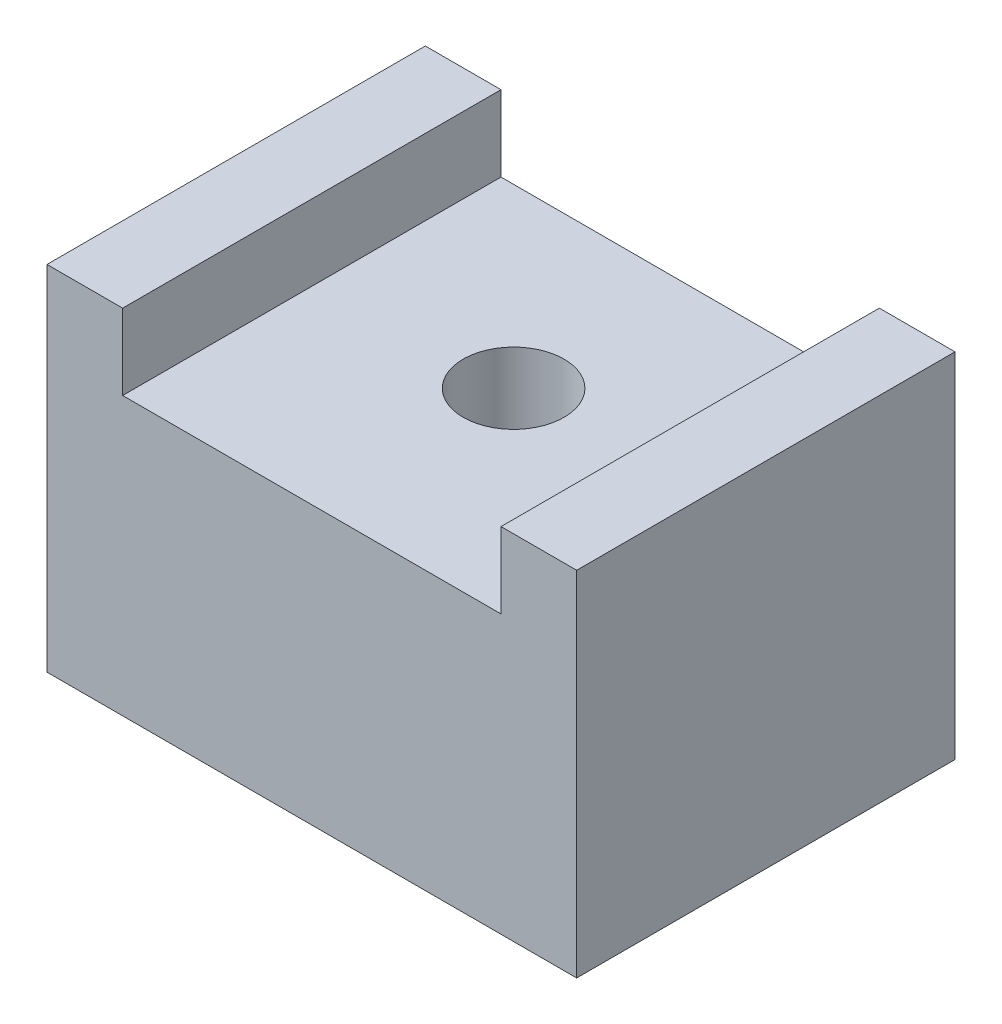
ISO-10303-21;
HEADER;
FILE_DESCRIPTION(('STEP AP214'),'2;1');
FILE_NAME('part.step','',(''),(''),'','','');
FILE_SCHEMA(('AUTOMOTIVE_DESIGN { 1 0 10303 214 1 1 1 1 }'));
ENDSEC;
DATA;
#1=APPLICATION_CONTEXT('core data for automotive mechanical design processes');
#2=APPLICATION_PROTOCOL_DEFINITION('international standard','automotive_design',2000,#1);
#3=PRODUCT_CONTEXT('',#1,'mechanical');
#4=PRODUCT('Part','Part','',(#3));
#5=PRODUCT_RELATED_PRODUCT_CATEGORY('part','',(#4));
#6=PRODUCT_DEFINITION_FORMATION('','',#4);
#7=PRODUCT_DEFINITION_CONTEXT('part definition',#1,'design');
#8=PRODUCT_DEFINITION('design','',#6,#7);
#9=PRODUCT_DEFINITION_SHAPE('','',#8);
#10=(LENGTH_UNIT() NAMED_UNIT(*) SI_UNIT(.MILLI.,.METRE.));
#11=(NAMED_UNIT(*) PLANE_ANGLE_UNIT() SI_UNIT($,.RADIAN.));
#12=(NAMED_UNIT(*) SI_UNIT($,.STERADIAN.) SOLID_ANGLE_UNIT());
#13=UNCERTAINTY_MEASURE_WITH_UNIT(LENGTH_MEASURE(1.E-05),#10,'distance_accuracy_value','');
#14=(GEOMETRIC_REPRESENTATION_CONTEXT(3) GLOBAL_UNCERTAINTY_ASSIGNED_CONTEXT((#13)) GLOBAL_UNIT_ASSIGNED_CONTEXT((#10,
#11,#12)) REPRESENTATION_CONTEXT('',''));
#15=CARTESIAN_POINT('',(0.,0.,0.));
#16=DIRECTION('',(0.,0.,1.));
#17=DIRECTION('',(1.,0.,0.));
#18=AXIS2_PLACEMENT_3D('',#15,#16,#17);
#19=CARTESIAN_POINT('',(10.5,-11.,15.));
#20=DIRECTION('',(-1.,0.,0.));
#21=DIRECTION('',(0.,-1.,0.));
#22=AXIS2_PLACEMENT_3D('',#19,#20,#21);
#23=PLANE('',#22);
#24=DIRECTION('',(0.,1.,0.));
#25=VECTOR('',#24,1.);
#26=CARTESIAN_POINT('',(10.5,-11.,0.));
#27=LINE('',#26,#25);
#28=CARTESIAN_POINT('',(10.5,-11.,0.));
#29=VERTEX_POINT('',#28);
#30=CARTESIAN_POINT('',(10.5,3.,0.));
#31=VERTEX_POINT('',#30);
#32=EDGE_CURVE('E129',#29,#31,#27,.T.);
#33=ORIENTED_EDGE('',*,*,#32,.T.);
#34=DIRECTION('',(0.,0.,-1.));
#35=VECTOR('',#34,1.);
#36=CARTESIAN_POINT('',(10.5,3.,15.));
#37=LINE('',#36,#35);
#38=CARTESIAN_POINT('',(10.5,3.,15.));
#39=VERTEX_POINT('',#38);
#40=EDGE_CURVE('E11',#39,#31,#37,.T.);
#41=ORIENTED_EDGE('',*,*,#40,.F.);
#42=DIRECTION('',(0.,1.,0.));
#43=VECTOR('',#42,1.);
#44=CARTESIAN_POINT('',(10.5,-11.,15.));
#45=LINE('',#44,#43);
#46=CARTESIAN_POINT('',(10.5,-11.,15.));
#47=VERTEX_POINT('',#46);
#48=EDGE_CURVE('E144',#47,#39,#45,.T.);
#49=ORIENTED_EDGE('',*,*,#48,.F.);
#50=DIRECTION('',(0.,0.,-1.));
#51=VECTOR('',#50,1.);
#52=CARTESIAN_POINT('',(10.5,-11.,15.));
#53=LINE('',#52,#51);
#54=EDGE_CURVE('E125',#47,#29,#53,.T.);
#55=ORIENTED_EDGE('',*,*,#54,.T.);
#56=EDGE_LOOP('',(#33,#41,#49,#55));
#57=FACE_BOUND('',#56,.T.);
#58=ADVANCED_FACE('F33',(#57),#23,.F.);
#59=CARTESIAN_POINT('',(10.5,3.,15.));
#60=DIRECTION('',(0.,-1.,0.));
#61=DIRECTION('',(1.,0.,0.));
#62=AXIS2_PLACEMENT_3D('',#59,#60,#61);
#63=PLANE('',#62);
#64=DIRECTION('',(-1.,0.,0.));
#65=VECTOR('',#64,1.);
#66=CARTESIAN_POINT('',(10.5,3.,0.));
#67=LINE('',#66,#65);
#68=CARTESIAN_POINT('',(7.5,3.,0.));
#69=VERTEX_POINT('',#68);
#70=EDGE_CURVE('E132',#31,#69,#67,.T.);
#71=ORIENTED_EDGE('',*,*,#70,.T.);
#72=DIRECTION('',(0.,0.,-1.));
#73=VECTOR('',#72,1.);
#74=CARTESIAN_POINT('',(7.5,3.,15.));
#75=LINE('',#74,#73);
#76=CARTESIAN_POINT('',(7.5,3.,15.));
#77=VERTEX_POINT('',#76);
#78=EDGE_CURVE('E41',#77,#69,#75,.T.);
#79=ORIENTED_EDGE('',*,*,#78,.F.);
#80=DIRECTION('',(-1.,0.,0.));
#81=VECTOR('',#80,1.);
#82=CARTESIAN_POINT('',(10.5,3.,15.));
#83=LINE('',#82,#81);
#84=EDGE_CURVE('E92',#39,#77,#83,.T.);
#85=ORIENTED_EDGE('',*,*,#84,.F.);
#86=ORIENTED_EDGE('',*,*,#40,.T.);
#87=EDGE_LOOP('',(#71,#79,#85,#86));
#88=FACE_BOUND('',#87,.T.);
#89=ADVANCED_FACE('F192',(#88),#63,.F.);
#90=CARTESIAN_POINT('',(7.5,3.,15.));
#91=DIRECTION('',(1.,0.,0.));
#92=DIRECTION('',(0.,1.,0.));
#93=AXIS2_PLACEMENT_3D('',#90,#91,#92);
#94=PLANE('',#93);
#95=DIRECTION('',(0.,-1.,0.));
#96=VECTOR('',#95,1.);
#97=CARTESIAN_POINT('',(7.5,3.,0.));
#98=LINE('',#97,#96);
#99=CARTESIAN_POINT('',(7.5,0.,0.));
#100=VERTEX_POINT('',#99);
#101=EDGE_CURVE('E135',#69,#100,#98,.T.);
#102=ORIENTED_EDGE('',*,*,#101,.T.);
#103=DIRECTION('',(0.,0.,-1.));
#104=VECTOR('',#103,1.);
#105=CARTESIAN_POINT('',(7.5,0.,15.));
#106=LINE('',#105,#104);
#107=CARTESIAN_POINT('',(7.5,0.,15.));
#108=VERTEX_POINT('',#107);
#109=EDGE_CURVE('E151',#108,#100,#106,.T.);
#110=ORIENTED_EDGE('',*,*,#109,.F.);
#111=DIRECTION('',(0.,-1.,0.));
#112=VECTOR('',#111,1.);
#113=CARTESIAN_POINT('',(7.5,3.,15.));
#114=LINE('',#113,#112);
#115=EDGE_CURVE('E159',#77,#108,#114,.T.);
#116=ORIENTED_EDGE('',*,*,#115,.F.);
#117=ORIENTED_EDGE('',*,*,#78,.T.);
#118=EDGE_LOOP('',(#102,#110,#116,#117));
#119=FACE_BOUND('',#118,.T.);
#120=ADVANCED_FACE('F157',(#119),#94,.F.);
#121=CARTESIAN_POINT('',(7.5,0.,15.));
#122=DIRECTION('',(0.,-1.,0.));
#123=DIRECTION('',(0.,0.,-1.));
#124=AXIS2_PLACEMENT_3D('',#121,#122,#123);
#125=PLANE('',#124);
#126=CARTESIAN_POINT('',(0.,0.,7.));
#127=DIRECTION('',(0.,1.,0.));
#128=DIRECTION('',(0.,0.,1.));
#129=AXIS2_PLACEMENT_3D('',#126,#127,#128);
#130=CIRCLE('',#129,2.);
#131=CARTESIAN_POINT('',(0.,0.,9.));
#132=VERTEX_POINT('',#131);
#133=EDGE_CURVE('E179',#132,#132,#130,.T.);
#134=ORIENTED_EDGE('',*,*,#133,.F.);
#135=EDGE_LOOP('',(#134));
#136=FACE_BOUND('',#135,.T.);
#137=DIRECTION('',(-1.,0.,0.));
#138=VECTOR('',#137,1.);
#139=CARTESIAN_POINT('',(7.5,0.,0.));
#140=LINE('',#139,#138);
#141=CARTESIAN_POINT('',(-7.5,0.,0.));
#142=VERTEX_POINT('',#141);
#143=EDGE_CURVE('E137',#100,#142,#140,.T.);
#144=ORIENTED_EDGE('',*,*,#143,.T.);
#145=DIRECTION('',(0.,0.,-1.));
#146=VECTOR('',#145,1.);
#147=CARTESIAN_POINT('',(-7.5,0.,15.));
#148=LINE('',#147,#146);
#149=CARTESIAN_POINT('',(-7.5,0.,15.));
#150=VERTEX_POINT('',#149);
#151=EDGE_CURVE('E148',#150,#142,#148,.T.);
#152=ORIENTED_EDGE('',*,*,#151,.F.);
#153=DIRECTION('',(-1.,0.,0.));
#154=VECTOR('',#153,1.);
#155=CARTESIAN_POINT('',(7.5,0.,15.));
#156=LINE('',#155,#154);
#157=EDGE_CURVE('E171',#108,#150,#156,.T.);
#158=ORIENTED_EDGE('',*,*,#157,.F.);
#159=ORIENTED_EDGE('',*,*,#109,.T.);
#160=EDGE_LOOP('',(#144,#152,#158,#159));
#161=FACE_BOUND('',#160,.T.);
#162=ADVANCED_FACE('F167',(#136,#161),#125,.F.);
#163=CARTESIAN_POINT('',(-7.5,0.,15.));
#164=DIRECTION('',(-1.,0.,0.));
#165=DIRECTION('',(0.,0.,1.));
#166=AXIS2_PLACEMENT_3D('',#163,#164,#165);
#167=PLANE('',#166);
#168=DIRECTION('',(0.,1.,0.));
#169=VECTOR('',#168,1.);
#170=CARTESIAN_POINT('',(-7.5,0.,0.));
#171=LINE('',#170,#169);
#172=CARTESIAN_POINT('',(-7.5,3.,0.));
#173=VERTEX_POINT('',#172);
#174=EDGE_CURVE('E139',#142,#173,#171,.T.);
#175=ORIENTED_EDGE('',*,*,#174,.T.);
#176=DIRECTION('',(0.,0.,-1.));
#177=VECTOR('',#176,1.);
#178=CARTESIAN_POINT('',(-7.5,3.,15.));
#179=LINE('',#178,#177);
#180=CARTESIAN_POINT('',(-7.5,3.,15.));
#181=VERTEX_POINT('',#180);
#182=EDGE_CURVE('E120',#181,#173,#179,.T.);
#183=ORIENTED_EDGE('',*,*,#182,.F.);
#184=DIRECTION('',(0.,1.,0.));
#185=VECTOR('',#184,1.);
#186=CARTESIAN_POINT('',(-7.5,0.,15.));
#187=LINE('',#186,#185);
#188=EDGE_CURVE('E111',#150,#181,#187,.T.);
#189=ORIENTED_EDGE('',*,*,#188,.F.);
#190=ORIENTED_EDGE('',*,*,#151,.T.);
#191=EDGE_LOOP('',(#175,#183,#189,#190));
#192=FACE_BOUND('',#191,.T.);
#193=ADVANCED_FACE('F170',(#192),#167,.F.);
#194=CARTESIAN_POINT('',(-7.5,3.,15.));
#195=DIRECTION('',(0.,-1.,0.));
#196=DIRECTION('',(1.,0.,0.));
#197=AXIS2_PLACEMENT_3D('',#194,#195,#196);
#198=PLANE('',#197);
#199=DIRECTION('',(-1.,0.,0.));
#200=VECTOR('',#199,1.);
#201=CARTESIAN_POINT('',(-7.5,3.,0.));
#202=LINE('',#201,#200);
#203=CARTESIAN_POINT('',(-10.5,3.,0.));
#204=VERTEX_POINT('',#203);
#205=EDGE_CURVE('E119',#173,#204,#202,.T.);
#206=ORIENTED_EDGE('',*,*,#205,.T.);
#207=DIRECTION('',(0.,0.,-1.));
#208=VECTOR('',#207,1.);
#209=CARTESIAN_POINT('',(-10.5,3.,15.));
#210=LINE('',#209,#208);
#211=CARTESIAN_POINT('',(-10.5,3.,15.));
#212=VERTEX_POINT('',#211);
#213=EDGE_CURVE('E116',#212,#204,#210,.T.);
#214=ORIENTED_EDGE('',*,*,#213,.F.);
#215=DIRECTION('',(-1.,0.,0.));
#216=VECTOR('',#215,1.);
#217=CARTESIAN_POINT('',(-7.5,3.,15.));
#218=LINE('',#217,#216);
#219=EDGE_CURVE('E105',#181,#212,#218,.T.);
#220=ORIENTED_EDGE('',*,*,#219,.F.);
#221=ORIENTED_EDGE('',*,*,#182,.T.);
#222=EDGE_LOOP('',(#206,#214,#220,#221));
#223=FACE_BOUND('',#222,.T.);
#224=ADVANCED_FACE('F117',(#223),#198,.F.);
#225=CARTESIAN_POINT('',(-10.5,3.,15.));
#226=DIRECTION('',(1.,0.,0.));
#227=DIRECTION('',(0.,1.,0.));
#228=AXIS2_PLACEMENT_3D('',#225,#226,#227);
#229=PLANE('',#228);
#230=DIRECTION('',(0.,-1.,0.));
#231=VECTOR('',#230,1.);
#232=CARTESIAN_POINT('',(-10.5,3.,0.));
#233=LINE('',#232,#231);
#234=CARTESIAN_POINT('',(-10.5,-11.,0.));
#235=VERTEX_POINT('',#234);
#236=EDGE_CURVE('E78',#204,#235,#233,.T.);
#237=ORIENTED_EDGE('',*,*,#236,.T.);
#238=DIRECTION('',(0.,0.,-1.));
#239=VECTOR('',#238,1.);
#240=CARTESIAN_POINT('',(-10.5,-11.,15.));
#241=LINE('',#240,#239);
#242=CARTESIAN_POINT('',(-10.5,-11.,15.));
#243=VERTEX_POINT('',#242);
#244=EDGE_CURVE('E121',#243,#235,#241,.T.);
#245=ORIENTED_EDGE('',*,*,#244,.F.);
#246=DIRECTION('',(0.,-1.,0.));
#247=VECTOR('',#246,1.);
#248=CARTESIAN_POINT('',(-10.5,3.,15.));
#249=LINE('',#248,#247);
#250=EDGE_CURVE('E109',#212,#243,#249,.T.);
#251=ORIENTED_EDGE('',*,*,#250,.F.);
#252=ORIENTED_EDGE('',*,*,#213,.T.);
#253=EDGE_LOOP('',(#237,#245,#251,#252));
#254=FACE_BOUND('',#253,.T.);
#255=ADVANCED_FACE('F123',(#254),#229,.F.);
#256=CARTESIAN_POINT('',(-10.5,-11.,15.));
#257=DIRECTION('',(0.,1.,0.));
#258=DIRECTION('',(-1.,0.,0.));
#259=AXIS2_PLACEMENT_3D('',#256,#257,#258);
#260=PLANE('',#259);
#261=CARTESIAN_POINT('',(0.,-11.,7.));
#262=DIRECTION('',(0.,1.,0.));
#263=DIRECTION('',(-1.,0.,0.));
#264=AXIS2_PLACEMENT_3D('',#261,#262,#263);
#265=CIRCLE('',#264,2.);
#266=CARTESIAN_POINT('',(-2.,-11.,7.));
#267=VERTEX_POINT('',#266);
#268=EDGE_CURVE('E133',#267,#267,#265,.F.);
#269=ORIENTED_EDGE('',*,*,#268,.F.);
#270=EDGE_LOOP('',(#269));
#271=FACE_BOUND('',#270,.T.);
#272=DIRECTION('',(1.,0.,0.));
#273=VECTOR('',#272,1.);
#274=CARTESIAN_POINT('',(-10.5,-11.,0.));
#275=LINE('',#274,#273);
#276=EDGE_CURVE('E84',#235,#29,#275,.T.);
#277=ORIENTED_EDGE('',*,*,#276,.T.);
#278=ORIENTED_EDGE('',*,*,#54,.F.);
#279=DIRECTION('',(1.,0.,0.));
#280=VECTOR('',#279,1.);
#281=CARTESIAN_POINT('',(-10.5,-11.,15.));
#282=LINE('',#281,#280);
#283=EDGE_CURVE('E49',#243,#47,#282,.T.);
#284=ORIENTED_EDGE('',*,*,#283,.F.);
#285=ORIENTED_EDGE('',*,*,#244,.T.);
#286=EDGE_LOOP('',(#277,#278,#284,#285));
#287=FACE_BOUND('',#286,.T.);
#288=ADVANCED_FACE('F201',(#271,#287),#260,.F.);
#289=CARTESIAN_POINT('',(0.,0.,15.));
#290=DIRECTION('',(0.,0.,1.));
#291=DIRECTION('',(1.,0.,0.));
#292=AXIS2_PLACEMENT_3D('',#289,#290,#291);
#293=PLANE('',#292);
#294=ORIENTED_EDGE('',*,*,#48,.T.);
#295=ORIENTED_EDGE('',*,*,#84,.T.);
#296=ORIENTED_EDGE('',*,*,#115,.T.);
#297=ORIENTED_EDGE('',*,*,#157,.T.);
#298=ORIENTED_EDGE('',*,*,#188,.T.);
#299=ORIENTED_EDGE('',*,*,#219,.T.);
#300=ORIENTED_EDGE('',*,*,#250,.T.);
#301=ORIENTED_EDGE('',*,*,#283,.T.);
#302=EDGE_LOOP('',(#294,#295,#296,#297,#298,#299,#300,#301));
#303=FACE_BOUND('',#302,.T.);
#304=ADVANCED_FACE('F107',(#303),#293,.T.);
#305=CARTESIAN_POINT('',(0.,0.,0.));
#306=DIRECTION('',(0.,0.,1.));
#307=DIRECTION('',(1.,0.,0.));
#308=AXIS2_PLACEMENT_3D('',#305,#306,#307);
#309=PLANE('',#308);
#310=ORIENTED_EDGE('',*,*,#32,.F.);
#311=ORIENTED_EDGE('',*,*,#276,.F.);
#312=ORIENTED_EDGE('',*,*,#236,.F.);
#313=ORIENTED_EDGE('',*,*,#205,.F.);
#314=ORIENTED_EDGE('',*,*,#174,.F.);
#315=ORIENTED_EDGE('',*,*,#143,.F.);
#316=ORIENTED_EDGE('',*,*,#101,.F.);
#317=ORIENTED_EDGE('',*,*,#70,.F.);
#318=EDGE_LOOP('',(#310,#311,#312,#313,#314,#315,#316,#317));
#319=FACE_BOUND('',#318,.T.);
#320=ADVANCED_FACE('F163',(#319),#309,.F.);
#321=CARTESIAN_POINT('',(0.,-16.6568542494924,7.));
#322=DIRECTION('',(0.,1.,0.));
#323=DIRECTION('',(0.,0.,1.));
#324=AXIS2_PLACEMENT_3D('',#321,#322,#323);
#325=CYLINDRICAL_SURFACE('',#324,2.);
#326=ORIENTED_EDGE('',*,*,#268,.T.);
#327=EDGE_LOOP('',(#326));
#328=FACE_BOUND('',#327,.T.);
#329=ORIENTED_EDGE('',*,*,#133,.T.);
#330=EDGE_LOOP('',(#329));
#331=FACE_BOUND('',#330,.T.);
#332=ADVANCED_FACE('F183',(#328,#331),#325,.F.);
#333=CLOSED_SHELL('',(#58,#89,#120,#162,#193,#224,#255,#288,#304,#320,#332));
#334=MANIFOLD_SOLID_BREP('B2',#333);
#335=ADVANCED_BREP_SHAPE_REPRESENTATION('',(#18,#334),#14);
#336=SHAPE_DEFINITION_REPRESENTATION(#9,#335);
ENDSEC;
END-ISO-10303-21;
